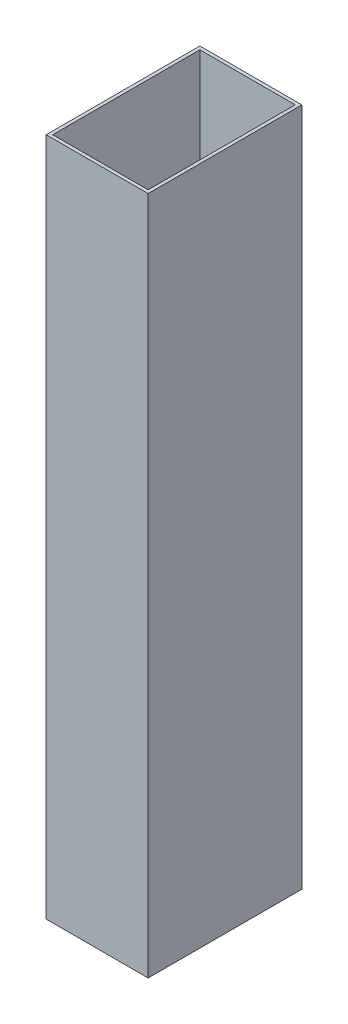
ISO-10303-21;
HEADER;
FILE_DESCRIPTION(('STEP AP214'),'2;1');
FILE_NAME('part.step','',(''),(''),'','','');
FILE_SCHEMA(('AUTOMOTIVE_DESIGN { 1 0 10303 214 1 1 1 1 }'));
ENDSEC;
DATA;
#1=APPLICATION_CONTEXT('core data for automotive mechanical design processes');
#2=APPLICATION_PROTOCOL_DEFINITION('international standard','automotive_design',2000,#1);
#3=PRODUCT_CONTEXT('',#1,'mechanical');
#4=PRODUCT('Part','Part','',(#3));
#5=PRODUCT_RELATED_PRODUCT_CATEGORY('part','',(#4));
#6=PRODUCT_DEFINITION_FORMATION('','',#4);
#7=PRODUCT_DEFINITION_CONTEXT('part definition',#1,'design');
#8=PRODUCT_DEFINITION('design','',#6,#7);
#9=PRODUCT_DEFINITION_SHAPE('','',#8);
#10=(LENGTH_UNIT() NAMED_UNIT(*) SI_UNIT(.MILLI.,.METRE.));
#11=(NAMED_UNIT(*) PLANE_ANGLE_UNIT() SI_UNIT($,.RADIAN.));
#12=(NAMED_UNIT(*) SI_UNIT($,.STERADIAN.) SOLID_ANGLE_UNIT());
#13=UNCERTAINTY_MEASURE_WITH_UNIT(LENGTH_MEASURE(1.E-05),#10,'distance_accuracy_value','');
#14=(GEOMETRIC_REPRESENTATION_CONTEXT(3) GLOBAL_UNCERTAINTY_ASSIGNED_CONTEXT((#13)) GLOBAL_UNIT_ASSIGNED_CONTEXT((#10,
#11,#12)) REPRESENTATION_CONTEXT('',''));
#15=CARTESIAN_POINT('',(0.,0.,0.));
#16=DIRECTION('',(0.,0.,1.));
#17=DIRECTION('',(1.,0.,0.));
#18=AXIS2_PLACEMENT_3D('',#15,#16,#17);
#19=CARTESIAN_POINT('',(0.,420.,0.));
#20=DIRECTION('',(0.,-1.,0.));
#21=DIRECTION('',(0.,0.,-1.));
#22=AXIS2_PLACEMENT_3D('',#19,#20,#21);
#23=PLANE('',#22);
#24=DIRECTION('',(0.,0.,1.));
#25=VECTOR('',#24,1.);
#26=CARTESIAN_POINT('',(-31.5,420.,-47.5));
#27=LINE('',#26,#25);
#28=CARTESIAN_POINT('',(-31.5,420.,-47.5));
#29=VERTEX_POINT('',#28);
#30=CARTESIAN_POINT('',(-31.5,420.,47.5));
#31=VERTEX_POINT('',#30);
#32=EDGE_CURVE('E134',#29,#31,#27,.T.);
#33=ORIENTED_EDGE('',*,*,#32,.T.);
#34=DIRECTION('',(1.,0.,0.));
#35=VECTOR('',#34,1.);
#36=CARTESIAN_POINT('',(31.5,420.,47.5));
#37=LINE('',#36,#35);
#38=CARTESIAN_POINT('',(31.5,420.,47.5));
#39=VERTEX_POINT('',#38);
#40=EDGE_CURVE('E137',#31,#39,#37,.T.);
#41=ORIENTED_EDGE('',*,*,#40,.T.);
#42=DIRECTION('',(0.,0.,-1.));
#43=VECTOR('',#42,1.);
#44=CARTESIAN_POINT('',(31.5,420.,-47.5));
#45=LINE('',#44,#43);
#46=CARTESIAN_POINT('',(31.5,420.,-47.5));
#47=VERTEX_POINT('',#46);
#48=EDGE_CURVE('E140',#39,#47,#45,.T.);
#49=ORIENTED_EDGE('',*,*,#48,.T.);
#50=DIRECTION('',(-1.,0.,0.));
#51=VECTOR('',#50,1.);
#52=CARTESIAN_POINT('',(31.5,420.,-47.5));
#53=LINE('',#52,#51);
#54=EDGE_CURVE('E142',#47,#29,#53,.T.);
#55=ORIENTED_EDGE('',*,*,#54,.T.);
#56=EDGE_LOOP('',(#33,#41,#49,#55));
#57=FACE_BOUND('',#56,.T.);
#58=DIRECTION('',(-1.,0.,0.));
#59=VECTOR('',#58,1.);
#60=CARTESIAN_POINT('',(29.5,420.,-45.5));
#61=LINE('',#60,#59);
#62=CARTESIAN_POINT('',(29.5,420.,-45.5));
#63=VERTEX_POINT('',#62);
#64=CARTESIAN_POINT('',(-29.5,420.,-45.5));
#65=VERTEX_POINT('',#64);
#66=EDGE_CURVE('E98',#63,#65,#61,.T.);
#67=ORIENTED_EDGE('',*,*,#66,.F.);
#68=DIRECTION('',(0.,0.,-1.));
#69=VECTOR('',#68,1.);
#70=CARTESIAN_POINT('',(29.5,420.,-45.5));
#71=LINE('',#70,#69);
#72=CARTESIAN_POINT('',(29.5,420.,45.5));
#73=VERTEX_POINT('',#72);
#74=EDGE_CURVE('E120',#73,#63,#71,.T.);
#75=ORIENTED_EDGE('',*,*,#74,.F.);
#76=DIRECTION('',(1.,0.,0.));
#77=VECTOR('',#76,1.);
#78=CARTESIAN_POINT('',(29.5,420.,45.5));
#79=LINE('',#78,#77);
#80=CARTESIAN_POINT('',(-29.5,420.,45.5));
#81=VERTEX_POINT('',#80);
#82=EDGE_CURVE('E118',#81,#73,#79,.T.);
#83=ORIENTED_EDGE('',*,*,#82,.F.);
#84=DIRECTION('',(0.,0.,1.));
#85=VECTOR('',#84,1.);
#86=CARTESIAN_POINT('',(-29.5,420.,-45.5));
#87=LINE('',#86,#85);
#88=EDGE_CURVE('E106',#65,#81,#87,.T.);
#89=ORIENTED_EDGE('',*,*,#88,.F.);
#90=EDGE_LOOP('',(#67,#75,#83,#89));
#91=FACE_BOUND('',#90,.T.);
#92=ADVANCED_FACE('F33',(#57,#91),#23,.F.);
#93=CARTESIAN_POINT('',(0.,0.,0.));
#94=DIRECTION('',(0.,-1.,0.));
#95=DIRECTION('',(0.,0.,-1.));
#96=AXIS2_PLACEMENT_3D('',#93,#94,#95);
#97=PLANE('',#96);
#98=DIRECTION('',(0.,0.,1.));
#99=VECTOR('',#98,1.);
#100=CARTESIAN_POINT('',(-31.5,0.,-47.5));
#101=LINE('',#100,#99);
#102=CARTESIAN_POINT('',(-31.5,0.,-47.5));
#103=VERTEX_POINT('',#102);
#104=CARTESIAN_POINT('',(-31.5,0.,47.5));
#105=VERTEX_POINT('',#104);
#106=EDGE_CURVE('E114',#103,#105,#101,.T.);
#107=ORIENTED_EDGE('',*,*,#106,.F.);
#108=DIRECTION('',(-1.,0.,0.));
#109=VECTOR('',#108,1.);
#110=CARTESIAN_POINT('',(31.5,0.,-47.5));
#111=LINE('',#110,#109);
#112=CARTESIAN_POINT('',(31.5,0.,-47.5));
#113=VERTEX_POINT('',#112);
#114=EDGE_CURVE('E138',#113,#103,#111,.T.);
#115=ORIENTED_EDGE('',*,*,#114,.F.);
#116=DIRECTION('',(0.,0.,-1.));
#117=VECTOR('',#116,1.);
#118=CARTESIAN_POINT('',(31.5,0.,-47.5));
#119=LINE('',#118,#117);
#120=CARTESIAN_POINT('',(31.5,0.,47.5));
#121=VERTEX_POINT('',#120);
#122=EDGE_CURVE('E149',#121,#113,#119,.T.);
#123=ORIENTED_EDGE('',*,*,#122,.F.);
#124=DIRECTION('',(1.,0.,0.));
#125=VECTOR('',#124,1.);
#126=CARTESIAN_POINT('',(31.5,0.,47.5));
#127=LINE('',#126,#125);
#128=EDGE_CURVE('E147',#105,#121,#127,.T.);
#129=ORIENTED_EDGE('',*,*,#128,.F.);
#130=EDGE_LOOP('',(#107,#115,#123,#129));
#131=FACE_BOUND('',#130,.T.);
#132=DIRECTION('',(0.,0.,-1.));
#133=VECTOR('',#132,1.);
#134=CARTESIAN_POINT('',(29.5,0.,-45.5));
#135=LINE('',#134,#133);
#136=CARTESIAN_POINT('',(29.5,0.,45.5));
#137=VERTEX_POINT('',#136);
#138=CARTESIAN_POINT('',(29.5,0.,-45.5));
#139=VERTEX_POINT('',#138);
#140=EDGE_CURVE('E107',#137,#139,#135,.T.);
#141=ORIENTED_EDGE('',*,*,#140,.T.);
#142=DIRECTION('',(-1.,0.,0.));
#143=VECTOR('',#142,1.);
#144=CARTESIAN_POINT('',(29.5,0.,-45.5));
#145=LINE('',#144,#143);
#146=CARTESIAN_POINT('',(-29.5,0.,-45.5));
#147=VERTEX_POINT('',#146);
#148=EDGE_CURVE('E56',#139,#147,#145,.T.);
#149=ORIENTED_EDGE('',*,*,#148,.T.);
#150=DIRECTION('',(0.,0.,1.));
#151=VECTOR('',#150,1.);
#152=CARTESIAN_POINT('',(-29.5,0.,-45.5));
#153=LINE('',#152,#151);
#154=CARTESIAN_POINT('',(-29.5,0.,45.5));
#155=VERTEX_POINT('',#154);
#156=EDGE_CURVE('E113',#147,#155,#153,.T.);
#157=ORIENTED_EDGE('',*,*,#156,.T.);
#158=DIRECTION('',(1.,0.,0.));
#159=VECTOR('',#158,1.);
#160=CARTESIAN_POINT('',(29.5,0.,45.5));
#161=LINE('',#160,#159);
#162=EDGE_CURVE('E126',#155,#137,#161,.T.);
#163=ORIENTED_EDGE('',*,*,#162,.T.);
#164=EDGE_LOOP('',(#141,#149,#157,#163));
#165=FACE_BOUND('',#164,.T.);
#166=ADVANCED_FACE('F167',(#131,#165),#97,.T.);
#167=CARTESIAN_POINT('',(-31.5,420.,-47.5));
#168=DIRECTION('',(1.,0.,0.));
#169=DIRECTION('',(0.,0.,-1.));
#170=AXIS2_PLACEMENT_3D('',#167,#168,#169);
#171=PLANE('',#170);
#172=ORIENTED_EDGE('',*,*,#106,.T.);
#173=DIRECTION('',(0.,-1.,0.));
#174=VECTOR('',#173,1.);
#175=CARTESIAN_POINT('',(-31.5,420.,47.5));
#176=LINE('',#175,#174);
#177=EDGE_CURVE('E11',#31,#105,#176,.T.);
#178=ORIENTED_EDGE('',*,*,#177,.F.);
#179=ORIENTED_EDGE('',*,*,#32,.F.);
#180=DIRECTION('',(0.,-1.,0.));
#181=VECTOR('',#180,1.);
#182=CARTESIAN_POINT('',(-31.5,420.,-47.5));
#183=LINE('',#182,#181);
#184=EDGE_CURVE('E144',#29,#103,#183,.T.);
#185=ORIENTED_EDGE('',*,*,#184,.T.);
#186=EDGE_LOOP('',(#172,#178,#179,#185));
#187=FACE_BOUND('',#186,.T.);
#188=ADVANCED_FACE('F35',(#187),#171,.F.);
#189=CARTESIAN_POINT('',(31.5,420.,47.5));
#190=DIRECTION('',(0.,0.,-1.));
#191=DIRECTION('',(-1.,0.,0.));
#192=AXIS2_PLACEMENT_3D('',#189,#190,#191);
#193=PLANE('',#192);
#194=ORIENTED_EDGE('',*,*,#128,.T.);
#195=DIRECTION('',(0.,-1.,0.));
#196=VECTOR('',#195,1.);
#197=CARTESIAN_POINT('',(31.5,420.,47.5));
#198=LINE('',#197,#196);
#199=EDGE_CURVE('E41',#39,#121,#198,.T.);
#200=ORIENTED_EDGE('',*,*,#199,.F.);
#201=ORIENTED_EDGE('',*,*,#40,.F.);
#202=ORIENTED_EDGE('',*,*,#177,.T.);
#203=EDGE_LOOP('',(#194,#200,#201,#202));
#204=FACE_BOUND('',#203,.T.);
#205=ADVANCED_FACE('F177',(#204),#193,.F.);
#206=CARTESIAN_POINT('',(31.5,420.,-47.5));
#207=DIRECTION('',(-1.,0.,0.));
#208=DIRECTION('',(0.,0.,1.));
#209=AXIS2_PLACEMENT_3D('',#206,#207,#208);
#210=PLANE('',#209);
#211=ORIENTED_EDGE('',*,*,#122,.T.);
#212=DIRECTION('',(0.,-1.,0.));
#213=VECTOR('',#212,1.);
#214=CARTESIAN_POINT('',(31.5,420.,-47.5));
#215=LINE('',#214,#213);
#216=EDGE_CURVE('E154',#47,#113,#215,.T.);
#217=ORIENTED_EDGE('',*,*,#216,.F.);
#218=ORIENTED_EDGE('',*,*,#48,.F.);
#219=ORIENTED_EDGE('',*,*,#199,.T.);
#220=EDGE_LOOP('',(#211,#217,#218,#219));
#221=FACE_BOUND('',#220,.T.);
#222=ADVANCED_FACE('F161',(#221),#210,.F.);
#223=CARTESIAN_POINT('',(31.5,420.,-47.5));
#224=DIRECTION('',(0.,0.,1.));
#225=DIRECTION('',(1.,0.,0.));
#226=AXIS2_PLACEMENT_3D('',#223,#224,#225);
#227=PLANE('',#226);
#228=ORIENTED_EDGE('',*,*,#114,.T.);
#229=ORIENTED_EDGE('',*,*,#184,.F.);
#230=ORIENTED_EDGE('',*,*,#54,.F.);
#231=ORIENTED_EDGE('',*,*,#216,.T.);
#232=EDGE_LOOP('',(#228,#229,#230,#231));
#233=FACE_BOUND('',#232,.T.);
#234=ADVANCED_FACE('F171',(#233),#227,.F.);
#235=CARTESIAN_POINT('',(29.5,420.,-45.5));
#236=DIRECTION('',(0.,0.,1.));
#237=DIRECTION('',(1.,0.,0.));
#238=AXIS2_PLACEMENT_3D('',#235,#236,#237);
#239=PLANE('',#238);
#240=ORIENTED_EDGE('',*,*,#148,.F.);
#241=DIRECTION('',(0.,-1.,0.));
#242=VECTOR('',#241,1.);
#243=CARTESIAN_POINT('',(29.5,420.,-45.5));
#244=LINE('',#243,#242);
#245=EDGE_CURVE('E102',#63,#139,#244,.T.);
#246=ORIENTED_EDGE('',*,*,#245,.F.);
#247=ORIENTED_EDGE('',*,*,#66,.T.);
#248=DIRECTION('',(0.,-1.,0.));
#249=VECTOR('',#248,1.);
#250=CARTESIAN_POINT('',(-29.5,420.,-45.5));
#251=LINE('',#250,#249);
#252=EDGE_CURVE('E101',#65,#147,#251,.T.);
#253=ORIENTED_EDGE('',*,*,#252,.T.);
#254=EDGE_LOOP('',(#240,#246,#247,#253));
#255=FACE_BOUND('',#254,.T.);
#256=ADVANCED_FACE('F100',(#255),#239,.T.);
#257=CARTESIAN_POINT('',(-29.5,420.,-45.5));
#258=DIRECTION('',(1.,0.,0.));
#259=DIRECTION('',(0.,0.,-1.));
#260=AXIS2_PLACEMENT_3D('',#257,#258,#259);
#261=PLANE('',#260);
#262=ORIENTED_EDGE('',*,*,#156,.F.);
#263=ORIENTED_EDGE('',*,*,#252,.F.);
#264=ORIENTED_EDGE('',*,*,#88,.T.);
#265=DIRECTION('',(0.,-1.,0.));
#266=VECTOR('',#265,1.);
#267=CARTESIAN_POINT('',(-29.5,420.,45.5));
#268=LINE('',#267,#266);
#269=EDGE_CURVE('E115',#81,#155,#268,.T.);
#270=ORIENTED_EDGE('',*,*,#269,.T.);
#271=EDGE_LOOP('',(#262,#263,#264,#270));
#272=FACE_BOUND('',#271,.T.);
#273=ADVANCED_FACE('F110',(#272),#261,.T.);
#274=CARTESIAN_POINT('',(29.5,420.,45.5));
#275=DIRECTION('',(0.,0.,-1.));
#276=DIRECTION('',(-1.,0.,0.));
#277=AXIS2_PLACEMENT_3D('',#274,#275,#276);
#278=PLANE('',#277);
#279=ORIENTED_EDGE('',*,*,#162,.F.);
#280=ORIENTED_EDGE('',*,*,#269,.F.);
#281=ORIENTED_EDGE('',*,*,#82,.T.);
#282=DIRECTION('',(0.,-1.,0.));
#283=VECTOR('',#282,1.);
#284=CARTESIAN_POINT('',(29.5,420.,45.5));
#285=LINE('',#284,#283);
#286=EDGE_CURVE('E48',#73,#137,#285,.T.);
#287=ORIENTED_EDGE('',*,*,#286,.T.);
#288=EDGE_LOOP('',(#279,#280,#281,#287));
#289=FACE_BOUND('',#288,.T.);
#290=ADVANCED_FACE('F200',(#289),#278,.T.);
#291=CARTESIAN_POINT('',(29.5,420.,-45.5));
#292=DIRECTION('',(-1.,0.,0.));
#293=DIRECTION('',(0.,0.,1.));
#294=AXIS2_PLACEMENT_3D('',#291,#292,#293);
#295=PLANE('',#294);
#296=ORIENTED_EDGE('',*,*,#140,.F.);
#297=ORIENTED_EDGE('',*,*,#286,.F.);
#298=ORIENTED_EDGE('',*,*,#74,.T.);
#299=ORIENTED_EDGE('',*,*,#245,.T.);
#300=EDGE_LOOP('',(#296,#297,#298,#299));
#301=FACE_BOUND('',#300,.T.);
#302=ADVANCED_FACE('F204',(#301),#295,.T.);
#303=CLOSED_SHELL('',(#92,#166,#188,#205,#222,#234,#256,#273,#290,#302));
#304=MANIFOLD_SOLID_BREP('B2',#303);
#305=ADVANCED_BREP_SHAPE_REPRESENTATION('',(#18,#304),#14);
#306=SHAPE_DEFINITION_REPRESENTATION(#9,#305);
ENDSEC;
END-ISO-10303-21;
